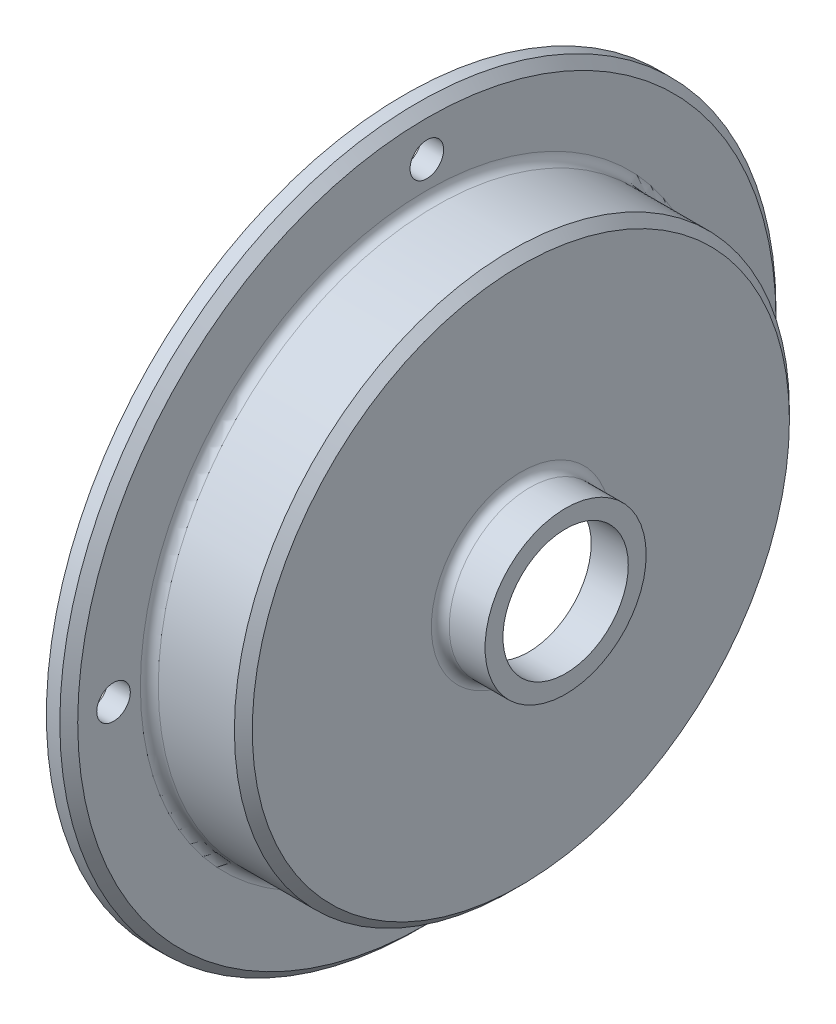
ISO-10303-21;
HEADER;
FILE_DESCRIPTION(('STEP AP214'),'2;1');
FILE_NAME('part.step','',(''),(''),'','','');
FILE_SCHEMA(('AUTOMOTIVE_DESIGN { 1 0 10303 214 1 1 1 1 }'));
ENDSEC;
DATA;
#1=APPLICATION_CONTEXT('core data for automotive mechanical design processes');
#2=APPLICATION_PROTOCOL_DEFINITION('international standard','automotive_design',2000,#1);
#3=PRODUCT_CONTEXT('',#1,'mechanical');
#4=PRODUCT('Part','Part','',(#3));
#5=PRODUCT_RELATED_PRODUCT_CATEGORY('part','',(#4));
#6=PRODUCT_DEFINITION_FORMATION('','',#4);
#7=PRODUCT_DEFINITION_CONTEXT('part definition',#1,'design');
#8=PRODUCT_DEFINITION('design','',#6,#7);
#9=PRODUCT_DEFINITION_SHAPE('','',#8);
#10=(LENGTH_UNIT() NAMED_UNIT(*) SI_UNIT(.MILLI.,.METRE.));
#11=(NAMED_UNIT(*) PLANE_ANGLE_UNIT() SI_UNIT($,.RADIAN.));
#12=(NAMED_UNIT(*) SI_UNIT($,.STERADIAN.) SOLID_ANGLE_UNIT());
#13=UNCERTAINTY_MEASURE_WITH_UNIT(LENGTH_MEASURE(1.E-05),#10,'distance_accuracy_value','');
#14=(GEOMETRIC_REPRESENTATION_CONTEXT(3) GLOBAL_UNCERTAINTY_ASSIGNED_CONTEXT((#13)) GLOBAL_UNIT_ASSIGNED_CONTEXT((#10,
#11,#12)) REPRESENTATION_CONTEXT('',''));
#15=CARTESIAN_POINT('',(0.,0.,0.));
#16=DIRECTION('',(0.,0.,1.));
#17=DIRECTION('',(1.,0.,0.));
#18=AXIS2_PLACEMENT_3D('',#15,#16,#17);
#19=CARTESIAN_POINT('',(5.36661584969392,-8.89,0.));
#20=DIRECTION('',(-1.,0.,0.));
#21=DIRECTION('',(0.,0.,1.));
#22=AXIS2_PLACEMENT_3D('',#19,#20,#21);
#23=PLANE('',#22);
#24=CARTESIAN_POINT('',(5.36661584969392,0.,0.));
#25=DIRECTION('',(1.,0.,0.));
#26=DIRECTION('',(0.,0.,-1.));
#27=AXIS2_PLACEMENT_3D('',#24,#25,#26);
#28=CIRCLE('',#27,8.89);
#29=CARTESIAN_POINT('',(5.36661584969392,0.,-8.89));
#30=VERTEX_POINT('',#29);
#31=EDGE_CURVE('E68',#30,#30,#28,.T.);
#32=ORIENTED_EDGE('',*,*,#31,.F.);
#33=EDGE_LOOP('',(#32));
#34=FACE_BOUND('',#33,.T.);
#35=CARTESIAN_POINT('',(5.36661584969392,0.,0.));
#36=DIRECTION('',(1.,0.,0.));
#37=DIRECTION('',(0.,0.,-1.));
#38=AXIS2_PLACEMENT_3D('',#35,#36,#37);
#39=CIRCLE('',#38,11.43);
#40=CARTESIAN_POINT('',(5.36661584969392,0.,-11.43));
#41=VERTEX_POINT('',#40);
#42=EDGE_CURVE('E77',#41,#41,#39,.T.);
#43=ORIENTED_EDGE('',*,*,#42,.T.);
#44=EDGE_LOOP('',(#43));
#45=FACE_BOUND('',#44,.T.);
#46=ADVANCED_FACE('F33',(#34,#45),#23,.F.);
#47=CARTESIAN_POINT('',(18.9358018681167,0.,0.));
#48=DIRECTION('',(1.,0.,0.));
#49=DIRECTION('',(0.,0.,-1.));
#50=AXIS2_PLACEMENT_3D('',#47,#48,#49);
#51=CYLINDRICAL_SURFACE('',#50,39.37);
#52=CARTESIAN_POINT('',(-2.25338415030613,0.,0.));
#53=DIRECTION('',(1.,0.,0.));
#54=DIRECTION('',(0.,0.,-1.));
#55=AXIS2_PLACEMENT_3D('',#52,#53,#54);
#56=CIRCLE('',#55,39.37);
#57=CARTESIAN_POINT('',(-2.25338415030613,0.,-39.37));
#58=VERTEX_POINT('',#57);
#59=EDGE_CURVE('E44',#58,#58,#56,.F.);
#60=ORIENTED_EDGE('',*,*,#59,.T.);
#61=EDGE_LOOP('',(#60));
#62=FACE_BOUND('',#61,.T.);
#63=CARTESIAN_POINT('',(-13.0483841503061,0.,0.));
#64=DIRECTION('',(-1.,0.,0.));
#65=DIRECTION('',(0.,0.,1.));
#66=AXIS2_PLACEMENT_3D('',#63,#64,#65);
#67=CIRCLE('',#66,39.37);
#68=CARTESIAN_POINT('',(-13.0483841503061,0.,39.37));
#69=VERTEX_POINT('',#68);
#70=EDGE_CURVE('E62',#69,#69,#67,.F.);
#71=ORIENTED_EDGE('',*,*,#70,.T.);
#72=EDGE_LOOP('',(#71));
#73=FACE_BOUND('',#72,.T.);
#74=ADVANCED_FACE('F128',(#62,#73),#51,.T.);
#75=CARTESIAN_POINT('',(0.104252054593405,0.,0.));
#76=DIRECTION('',(-1.,0.,0.));
#77=DIRECTION('',(0.,0.,1.));
#78=AXIS2_PLACEMENT_3D('',#75,#76,#77);
#79=CONICAL_SURFACE('',#78,8.89,1.04719755119661);
#80=CARTESIAN_POINT('',(-17.4933841503061,0.,0.));
#81=DIRECTION('',(1.,0.,0.));
#82=DIRECTION('',(0.,0.,-1.));
#83=AXIS2_PLACEMENT_3D('',#80,#81,#82);
#84=CIRCLE('',#83,39.37);
#85=CARTESIAN_POINT('',(-17.4933841503061,0.,-39.37));
#86=VERTEX_POINT('',#85);
#87=EDGE_CURVE('E74',#86,#86,#84,.T.);
#88=ORIENTED_EDGE('',*,*,#87,.F.);
#89=EDGE_LOOP('',(#88));
#90=FACE_BOUND('',#89,.T.);
#91=CARTESIAN_POINT('',(0.104252054593405,0.,0.));
#92=DIRECTION('',(1.,0.,0.));
#93=DIRECTION('',(0.,0.,-1.));
#94=AXIS2_PLACEMENT_3D('',#91,#92,#93);
#95=CIRCLE('',#94,8.89);
#96=CARTESIAN_POINT('',(0.104252054593405,0.,-8.89));
#97=VERTEX_POINT('',#96);
#98=EDGE_CURVE('E65',#97,#97,#95,.T.);
#99=ORIENTED_EDGE('',*,*,#98,.T.);
#100=EDGE_LOOP('',(#99));
#101=FACE_BOUND('',#100,.T.);
#102=ADVANCED_FACE('F124',(#90,#101),#79,.F.);
#103=CARTESIAN_POINT('',(18.9358018681167,0.,0.));
#104=DIRECTION('',(1.,0.,0.));
#105=DIRECTION('',(0.,0.,-1.));
#106=AXIS2_PLACEMENT_3D('',#103,#104,#105);
#107=CYLINDRICAL_SURFACE('',#106,8.89);
#108=ORIENTED_EDGE('',*,*,#98,.F.);
#109=EDGE_LOOP('',(#108));
#110=FACE_BOUND('',#109,.T.);
#111=ORIENTED_EDGE('',*,*,#31,.T.);
#112=EDGE_LOOP('',(#111));
#113=FACE_BOUND('',#112,.T.);
#114=ADVANCED_FACE('F127',(#110,#113),#107,.F.);
#115=CARTESIAN_POINT('',(-14.3183841503061,-50.8,0.));
#116=DIRECTION('',(-1.,0.,0.));
#117=DIRECTION('',(0.,0.,1.));
#118=AXIS2_PLACEMENT_3D('',#115,#116,#117);
#119=PLANE('',#118);
#120=CARTESIAN_POINT('',(-14.3183841503061,0.,-44.45));
#121=DIRECTION('',(-1.,0.,0.));
#122=DIRECTION('',(0.,0.,1.));
#123=AXIS2_PLACEMENT_3D('',#120,#121,#122);
#124=CIRCLE('',#123,2.38124999999999);
#125=CARTESIAN_POINT('',(-14.3183841503061,0.,-42.06875));
#126=VERTEX_POINT('',#125);
#127=EDGE_CURVE('E98',#126,#126,#124,.T.);
#128=ORIENTED_EDGE('',*,*,#127,.T.);
#129=EDGE_LOOP('',(#128));
#130=FACE_BOUND('',#129,.T.);
#131=CARTESIAN_POINT('',(-14.3183841503061,44.45,0.));
#132=DIRECTION('',(-1.,0.,0.));
#133=DIRECTION('',(0.,0.,1.));
#134=AXIS2_PLACEMENT_3D('',#131,#132,#133);
#135=CIRCLE('',#134,2.38124999999999);
#136=CARTESIAN_POINT('',(-14.3183841503061,44.45,2.38124999999999));
#137=VERTEX_POINT('',#136);
#138=EDGE_CURVE('E92',#137,#137,#135,.T.);
#139=ORIENTED_EDGE('',*,*,#138,.T.);
#140=EDGE_LOOP('',(#139));
#141=FACE_BOUND('',#140,.T.);
#142=CARTESIAN_POINT('',(-14.3183841503061,0.,44.45));
#143=DIRECTION('',(-1.,0.,0.));
#144=DIRECTION('',(0.,0.,1.));
#145=AXIS2_PLACEMENT_3D('',#142,#143,#144);
#146=CIRCLE('',#145,2.38124999999999);
#147=CARTESIAN_POINT('',(-14.3183841503061,0.,46.83125));
#148=VERTEX_POINT('',#147);
#149=EDGE_CURVE('E86',#148,#148,#146,.T.);
#150=ORIENTED_EDGE('',*,*,#149,.T.);
#151=EDGE_LOOP('',(#150));
#152=FACE_BOUND('',#151,.T.);
#153=CARTESIAN_POINT('',(-14.3183841503061,-44.45,0.));
#154=DIRECTION('',(-1.,0.,0.));
#155=DIRECTION('',(0.,0.,1.));
#156=AXIS2_PLACEMENT_3D('',#153,#154,#155);
#157=CIRCLE('',#156,2.38124999999999);
#158=CARTESIAN_POINT('',(-14.3183841503061,-44.45,2.38124999999999));
#159=VERTEX_POINT('',#158);
#160=EDGE_CURVE('E80',#159,#159,#157,.T.);
#161=ORIENTED_EDGE('',*,*,#160,.T.);
#162=EDGE_LOOP('',(#161));
#163=FACE_BOUND('',#162,.T.);
#164=CARTESIAN_POINT('',(-14.3183841503061,0.,0.));
#165=DIRECTION('',(-1.,0.,0.));
#166=DIRECTION('',(0.,0.,1.));
#167=AXIS2_PLACEMENT_3D('',#164,#165,#166);
#168=CIRCLE('',#167,49.53);
#169=CARTESIAN_POINT('',(-14.3183841503061,0.,49.53));
#170=VERTEX_POINT('',#169);
#171=EDGE_CURVE('E56',#170,#170,#168,.F.);
#172=ORIENTED_EDGE('',*,*,#171,.T.);
#173=EDGE_LOOP('',(#172));
#174=FACE_BOUND('',#173,.T.);
#175=CARTESIAN_POINT('',(-14.3183841503061,0.,0.));
#176=DIRECTION('',(-1.,0.,0.));
#177=DIRECTION('',(0.,0.,1.));
#178=AXIS2_PLACEMENT_3D('',#175,#176,#177);
#179=CIRCLE('',#178,40.64);
#180=CARTESIAN_POINT('',(-14.3183841503061,0.,40.64));
#181=VERTEX_POINT('',#180);
#182=EDGE_CURVE('E59',#181,#181,#179,.T.);
#183=ORIENTED_EDGE('',*,*,#182,.T.);
#184=EDGE_LOOP('',(#183));
#185=FACE_BOUND('',#184,.T.);
#186=ADVANCED_FACE('F134',(#130,#141,#152,#163,#174,#185),#119,.F.);
#187=CARTESIAN_POINT('',(18.9358018681167,0.,0.));
#188=DIRECTION('',(1.,0.,0.));
#189=DIRECTION('',(0.,0.,-1.));
#190=AXIS2_PLACEMENT_3D('',#187,#188,#189);
#191=CYLINDRICAL_SURFACE('',#190,50.8);
#192=CARTESIAN_POINT('',(-15.5883841503061,0.,0.));
#193=DIRECTION('',(-1.,0.,0.));
#194=DIRECTION('',(0.,0.,1.));
#195=AXIS2_PLACEMENT_3D('',#192,#193,#194);
#196=CIRCLE('',#195,50.8);
#197=CARTESIAN_POINT('',(-15.5883841503061,0.,50.8));
#198=VERTEX_POINT('',#197);
#199=EDGE_CURVE('E53',#198,#198,#196,.T.);
#200=ORIENTED_EDGE('',*,*,#199,.T.);
#201=EDGE_LOOP('',(#200));
#202=FACE_BOUND('',#201,.T.);
#203=CARTESIAN_POINT('',(-17.4933841503061,0.,0.));
#204=DIRECTION('',(1.,0.,0.));
#205=DIRECTION('',(0.,0.,-1.));
#206=AXIS2_PLACEMENT_3D('',#203,#204,#205);
#207=CIRCLE('',#206,50.8);
#208=CARTESIAN_POINT('',(-17.4933841503061,0.,-50.8));
#209=VERTEX_POINT('',#208);
#210=EDGE_CURVE('E71',#209,#209,#207,.T.);
#211=ORIENTED_EDGE('',*,*,#210,.T.);
#212=EDGE_LOOP('',(#211));
#213=FACE_BOUND('',#212,.T.);
#214=ADVANCED_FACE('F112',(#202,#213),#191,.T.);
#215=CARTESIAN_POINT('',(-17.4933841503061,-39.37,0.));
#216=DIRECTION('',(1.,0.,0.));
#217=DIRECTION('',(0.,0.,-1.));
#218=AXIS2_PLACEMENT_3D('',#215,#216,#217);
#219=PLANE('',#218);
#220=CARTESIAN_POINT('',(-17.4933841503061,0.,-44.45));
#221=DIRECTION('',(-1.,0.,0.));
#222=DIRECTION('',(0.,0.,1.));
#223=AXIS2_PLACEMENT_3D('',#220,#221,#222);
#224=CIRCLE('',#223,2.38124999999999);
#225=CARTESIAN_POINT('',(-17.4933841503061,0.,-42.06875));
#226=VERTEX_POINT('',#225);
#227=EDGE_CURVE('E101',#226,#226,#224,.T.);
#228=ORIENTED_EDGE('',*,*,#227,.F.);
#229=EDGE_LOOP('',(#228));
#230=FACE_BOUND('',#229,.T.);
#231=CARTESIAN_POINT('',(-17.4933841503061,44.45,0.));
#232=DIRECTION('',(-1.,0.,0.));
#233=DIRECTION('',(0.,0.,1.));
#234=AXIS2_PLACEMENT_3D('',#231,#232,#233);
#235=CIRCLE('',#234,2.38124999999999);
#236=CARTESIAN_POINT('',(-17.4933841503061,44.45,2.38124999999999));
#237=VERTEX_POINT('',#236);
#238=EDGE_CURVE('E95',#237,#237,#235,.T.);
#239=ORIENTED_EDGE('',*,*,#238,.F.);
#240=EDGE_LOOP('',(#239));
#241=FACE_BOUND('',#240,.T.);
#242=CARTESIAN_POINT('',(-17.4933841503061,0.,44.45));
#243=DIRECTION('',(-1.,0.,0.));
#244=DIRECTION('',(0.,0.,1.));
#245=AXIS2_PLACEMENT_3D('',#242,#243,#244);
#246=CIRCLE('',#245,2.38124999999999);
#247=CARTESIAN_POINT('',(-17.4933841503061,0.,46.83125));
#248=VERTEX_POINT('',#247);
#249=EDGE_CURVE('E89',#248,#248,#246,.T.);
#250=ORIENTED_EDGE('',*,*,#249,.F.);
#251=EDGE_LOOP('',(#250));
#252=FACE_BOUND('',#251,.T.);
#253=CARTESIAN_POINT('',(-17.4933841503061,-44.45,0.));
#254=DIRECTION('',(-1.,0.,0.));
#255=DIRECTION('',(0.,0.,1.));
#256=AXIS2_PLACEMENT_3D('',#253,#254,#255);
#257=CIRCLE('',#256,2.38124999999999);
#258=CARTESIAN_POINT('',(-17.4933841503061,-44.45,2.38124999999999));
#259=VERTEX_POINT('',#258);
#260=EDGE_CURVE('E83',#259,#259,#257,.T.);
#261=ORIENTED_EDGE('',*,*,#260,.F.);
#262=EDGE_LOOP('',(#261));
#263=FACE_BOUND('',#262,.T.);
#264=ORIENTED_EDGE('',*,*,#210,.F.);
#265=EDGE_LOOP('',(#264));
#266=FACE_BOUND('',#265,.T.);
#267=ORIENTED_EDGE('',*,*,#87,.T.);
#268=EDGE_LOOP('',(#267));
#269=FACE_BOUND('',#268,.T.);
#270=ADVANCED_FACE('F108',(#230,#241,#252,#263,#266,#269),#219,.F.);
#271=CARTESIAN_POINT('',(-13.0483841503061,0.,0.));
#272=DIRECTION('',(-1.,0.,0.));
#273=DIRECTION('',(0.,0.,1.));
#274=AXIS2_PLACEMENT_3D('',#271,#272,#273);
#275=TOROIDAL_SURFACE('',#274,40.64,1.27);
#276=ORIENTED_EDGE('',*,*,#182,.F.);
#277=EDGE_LOOP('',(#276));
#278=FACE_BOUND('',#277,.T.);
#279=ORIENTED_EDGE('',*,*,#70,.F.);
#280=EDGE_LOOP('',(#279));
#281=FACE_BOUND('',#280,.T.);
#282=ADVANCED_FACE('F111',(#278,#281),#275,.F.);
#283=CARTESIAN_POINT('',(-0.983384150306082,0.,0.));
#284=DIRECTION('',(1.,0.,0.));
#285=DIRECTION('',(0.,0.,-1.));
#286=AXIS2_PLACEMENT_3D('',#283,#284,#285);
#287=PLANE('',#286);
#288=CARTESIAN_POINT('',(-0.983384150306082,0.,0.));
#289=DIRECTION('',(1.,0.,0.));
#290=DIRECTION('',(0.,0.,-1.));
#291=AXIS2_PLACEMENT_3D('',#288,#289,#290);
#292=CIRCLE('',#291,12.7);
#293=CARTESIAN_POINT('',(-0.983384150306082,0.,-12.7));
#294=VERTEX_POINT('',#293);
#295=EDGE_CURVE('E10',#294,#294,#292,.F.);
#296=ORIENTED_EDGE('',*,*,#295,.T.);
#297=EDGE_LOOP('',(#296));
#298=FACE_BOUND('',#297,.T.);
#299=CARTESIAN_POINT('',(-0.983384150306082,0.,0.));
#300=DIRECTION('',(1.,0.,0.));
#301=DIRECTION('',(0.,0.,-1.));
#302=AXIS2_PLACEMENT_3D('',#299,#300,#301);
#303=CIRCLE('',#302,38.1);
#304=CARTESIAN_POINT('',(-0.983384150306082,0.,-38.1));
#305=VERTEX_POINT('',#304);
#306=EDGE_CURVE('E48',#305,#305,#303,.T.);
#307=ORIENTED_EDGE('',*,*,#306,.T.);
#308=EDGE_LOOP('',(#307));
#309=FACE_BOUND('',#308,.T.);
#310=ADVANCED_FACE('F146',(#298,#309),#287,.T.);
#311=CARTESIAN_POINT('',(-0.983384150306082,0.,0.));
#312=DIRECTION('',(1.,0.,0.));
#313=DIRECTION('',(0.,0.,-1.));
#314=AXIS2_PLACEMENT_3D('',#311,#312,#313);
#315=CYLINDRICAL_SURFACE('',#314,11.43);
#316=CARTESIAN_POINT('',(0.286615849693918,0.,0.));
#317=DIRECTION('',(1.,0.,0.));
#318=DIRECTION('',(0.,0.,-1.));
#319=AXIS2_PLACEMENT_3D('',#316,#317,#318);
#320=CIRCLE('',#319,11.43);
#321=CARTESIAN_POINT('',(0.286615849693918,0.,-11.43));
#322=VERTEX_POINT('',#321);
#323=EDGE_CURVE('E40',#322,#322,#320,.T.);
#324=ORIENTED_EDGE('',*,*,#323,.T.);
#325=EDGE_LOOP('',(#324));
#326=FACE_BOUND('',#325,.T.);
#327=ORIENTED_EDGE('',*,*,#42,.F.);
#328=EDGE_LOOP('',(#327));
#329=FACE_BOUND('',#328,.T.);
#330=ADVANCED_FACE('F143',(#326,#329),#315,.T.);
#331=CARTESIAN_POINT('',(-14.3183841503061,0.,0.));
#332=DIRECTION('',(-1.,0.,0.));
#333=DIRECTION('',(0.,0.,1.));
#334=AXIS2_PLACEMENT_3D('',#331,#332,#333);
#335=CONICAL_SURFACE('',#334,49.53,0.785398163397446);
#336=ORIENTED_EDGE('',*,*,#199,.F.);
#337=EDGE_LOOP('',(#336));
#338=FACE_BOUND('',#337,.T.);
#339=ORIENTED_EDGE('',*,*,#171,.F.);
#340=EDGE_LOOP('',(#339));
#341=FACE_BOUND('',#340,.T.);
#342=ADVANCED_FACE('F145',(#338,#341),#335,.T.);
#343=CARTESIAN_POINT('',(-0.983384150306084,0.,0.));
#344=DIRECTION('',(-1.,0.,0.));
#345=DIRECTION('',(0.,0.,1.));
#346=AXIS2_PLACEMENT_3D('',#343,#344,#345);
#347=CONICAL_SURFACE('',#346,38.1,0.785398163397451);
#348=ORIENTED_EDGE('',*,*,#59,.F.);
#349=EDGE_LOOP('',(#348));
#350=FACE_BOUND('',#349,.T.);
#351=ORIENTED_EDGE('',*,*,#306,.F.);
#352=EDGE_LOOP('',(#351));
#353=FACE_BOUND('',#352,.T.);
#354=ADVANCED_FACE('F152',(#350,#353),#347,.T.);
#355=CARTESIAN_POINT('',(0.286615849693918,0.,0.));
#356=DIRECTION('',(1.,0.,0.));
#357=DIRECTION('',(0.,0.,-1.));
#358=AXIS2_PLACEMENT_3D('',#355,#356,#357);
#359=TOROIDAL_SURFACE('',#358,12.7,1.27);
#360=ORIENTED_EDGE('',*,*,#295,.F.);
#361=EDGE_LOOP('',(#360));
#362=FACE_BOUND('',#361,.T.);
#363=ORIENTED_EDGE('',*,*,#323,.F.);
#364=EDGE_LOOP('',(#363));
#365=FACE_BOUND('',#364,.T.);
#366=ADVANCED_FACE('F35',(#362,#365),#359,.F.);
#367=CARTESIAN_POINT('',(-17.4933841503061,-44.45,0.));
#368=DIRECTION('',(-1.,0.,0.));
#369=DIRECTION('',(0.,0.,1.));
#370=AXIS2_PLACEMENT_3D('',#367,#368,#369);
#371=CYLINDRICAL_SURFACE('',#370,2.38124999999999);
#372=ORIENTED_EDGE('',*,*,#260,.T.);
#373=EDGE_LOOP('',(#372));
#374=FACE_BOUND('',#373,.T.);
#375=ORIENTED_EDGE('',*,*,#160,.F.);
#376=EDGE_LOOP('',(#375));
#377=FACE_BOUND('',#376,.T.);
#378=ADVANCED_FACE('F157',(#374,#377),#371,.F.);
#379=CARTESIAN_POINT('',(-17.4933841503061,0.,44.45));
#380=DIRECTION('',(-1.,0.,0.));
#381=DIRECTION('',(0.,0.,1.));
#382=AXIS2_PLACEMENT_3D('',#379,#380,#381);
#383=CYLINDRICAL_SURFACE('',#382,2.38124999999999);
#384=ORIENTED_EDGE('',*,*,#249,.T.);
#385=EDGE_LOOP('',(#384));
#386=FACE_BOUND('',#385,.T.);
#387=ORIENTED_EDGE('',*,*,#149,.F.);
#388=EDGE_LOOP('',(#387));
#389=FACE_BOUND('',#388,.T.);
#390=ADVANCED_FACE('F187',(#386,#389),#383,.F.);
#391=CARTESIAN_POINT('',(-17.4933841503061,44.45,0.));
#392=DIRECTION('',(-1.,0.,0.));
#393=DIRECTION('',(0.,0.,1.));
#394=AXIS2_PLACEMENT_3D('',#391,#392,#393);
#395=CYLINDRICAL_SURFACE('',#394,2.38124999999999);
#396=ORIENTED_EDGE('',*,*,#238,.T.);
#397=EDGE_LOOP('',(#396));
#398=FACE_BOUND('',#397,.T.);
#399=ORIENTED_EDGE('',*,*,#138,.F.);
#400=EDGE_LOOP('',(#399));
#401=FACE_BOUND('',#400,.T.);
#402=ADVANCED_FACE('F193',(#398,#401),#395,.F.);
#403=CARTESIAN_POINT('',(-17.4933841503061,0.,-44.45));
#404=DIRECTION('',(-1.,0.,0.));
#405=DIRECTION('',(0.,0.,1.));
#406=AXIS2_PLACEMENT_3D('',#403,#404,#405);
#407=CYLINDRICAL_SURFACE('',#406,2.38124999999999);
#408=ORIENTED_EDGE('',*,*,#227,.T.);
#409=EDGE_LOOP('',(#408));
#410=FACE_BOUND('',#409,.T.);
#411=ORIENTED_EDGE('',*,*,#127,.F.);
#412=EDGE_LOOP('',(#411));
#413=FACE_BOUND('',#412,.T.);
#414=ADVANCED_FACE('F105',(#410,#413),#407,.F.);
#415=CLOSED_SHELL('',(#46,#74,#102,#114,#186,#214,#270,#282,#310,#330,#342,#354,#366,#378,#390,
#402,#414));
#416=MANIFOLD_SOLID_BREP('B2',#415);
#417=ADVANCED_BREP_SHAPE_REPRESENTATION('',(#18,#416),#14);
#418=SHAPE_DEFINITION_REPRESENTATION(#9,#417);
ENDSEC;
END-ISO-10303-21;
